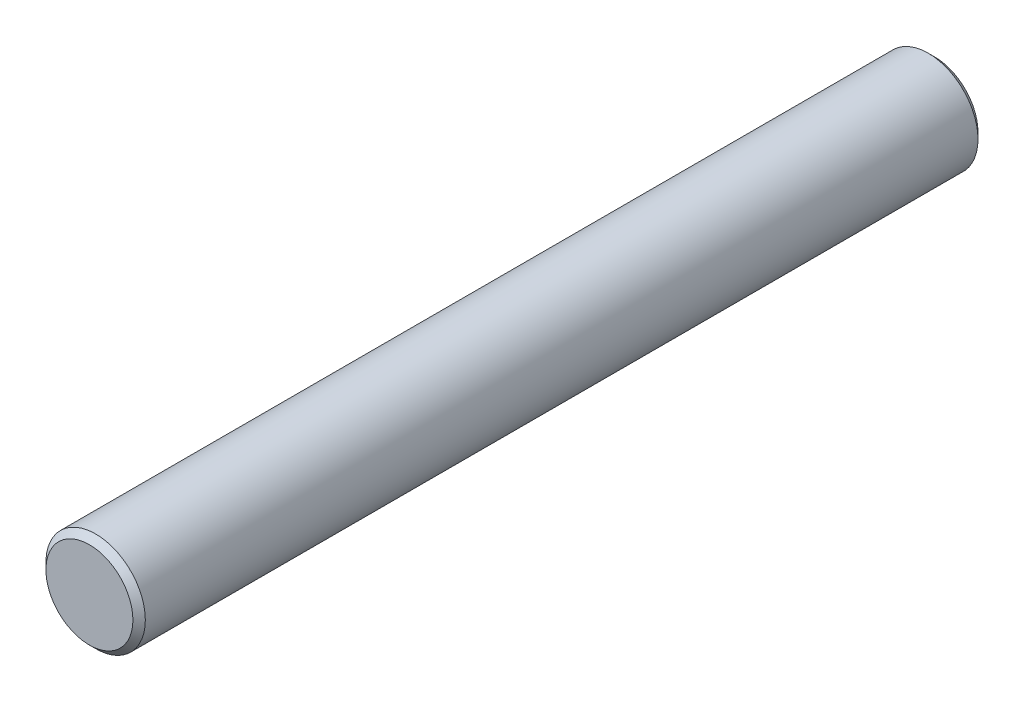
ISO-10303-21;
HEADER;
FILE_DESCRIPTION(('STEP AP214'),'2;1');
FILE_NAME('part.step','',(''),(''),'','','');
FILE_SCHEMA(('AUTOMOTIVE_DESIGN { 1 0 10303 214 1 1 1 1 }'));
ENDSEC;
DATA;
#1=APPLICATION_CONTEXT('core data for automotive mechanical design processes');
#2=APPLICATION_PROTOCOL_DEFINITION('international standard','automotive_design',2000,#1);
#3=PRODUCT_CONTEXT('',#1,'mechanical');
#4=PRODUCT('Part','Part','',(#3));
#5=PRODUCT_RELATED_PRODUCT_CATEGORY('part','',(#4));
#6=PRODUCT_DEFINITION_FORMATION('','',#4);
#7=PRODUCT_DEFINITION_CONTEXT('part definition',#1,'design');
#8=PRODUCT_DEFINITION('design','',#6,#7);
#9=PRODUCT_DEFINITION_SHAPE('','',#8);
#10=(LENGTH_UNIT() NAMED_UNIT(*) SI_UNIT(.MILLI.,.METRE.));
#11=(NAMED_UNIT(*) PLANE_ANGLE_UNIT() SI_UNIT($,.RADIAN.));
#12=(NAMED_UNIT(*) SI_UNIT($,.STERADIAN.) SOLID_ANGLE_UNIT());
#13=UNCERTAINTY_MEASURE_WITH_UNIT(LENGTH_MEASURE(1.E-05),#10,'distance_accuracy_value','');
#14=(GEOMETRIC_REPRESENTATION_CONTEXT(3) GLOBAL_UNCERTAINTY_ASSIGNED_CONTEXT((#13)) GLOBAL_UNIT_ASSIGNED_CONTEXT((#10,
#11,#12)) REPRESENTATION_CONTEXT('',''));
#15=CARTESIAN_POINT('',(0.,0.,0.));
#16=DIRECTION('',(0.,0.,1.));
#17=DIRECTION('',(1.,0.,0.));
#18=AXIS2_PLACEMENT_3D('',#15,#16,#17);
#19=CARTESIAN_POINT('',(0.,0.,68.));
#20=DIRECTION('',(0.,0.,-1.));
#21=DIRECTION('',(-1.,0.,0.));
#22=AXIS2_PLACEMENT_3D('',#19,#20,#21);
#23=CYLINDRICAL_SURFACE('',#22,8.);
#24=CARTESIAN_POINT('',(0.,0.,-67.));
#25=DIRECTION('',(0.,0.,1.));
#26=DIRECTION('',(1.,0.,0.));
#27=AXIS2_PLACEMENT_3D('',#24,#25,#26);
#28=CIRCLE('',#27,8.);
#29=CARTESIAN_POINT('',(8.,0.,-67.));
#30=VERTEX_POINT('',#29);
#31=EDGE_CURVE('E50',#30,#30,#28,.T.);
#32=ORIENTED_EDGE('',*,*,#31,.T.);
#33=EDGE_LOOP('',(#32));
#34=FACE_BOUND('',#33,.T.);
#35=CARTESIAN_POINT('',(0.,0.,67.));
#36=DIRECTION('',(0.,0.,1.));
#37=DIRECTION('',(1.,0.,0.));
#38=AXIS2_PLACEMENT_3D('',#35,#36,#37);
#39=CIRCLE('',#38,8.);
#40=CARTESIAN_POINT('',(8.,0.,67.));
#41=VERTEX_POINT('',#40);
#42=EDGE_CURVE('E55',#41,#41,#39,.F.);
#43=ORIENTED_EDGE('',*,*,#42,.T.);
#44=EDGE_LOOP('',(#43));
#45=FACE_BOUND('',#44,.T.);
#46=ADVANCED_FACE('F37',(#34,#45),#23,.T.);
#47=CARTESIAN_POINT('',(0.,0.,68.));
#48=DIRECTION('',(0.,0.,1.));
#49=DIRECTION('',(1.,0.,0.));
#50=AXIS2_PLACEMENT_3D('',#47,#48,#49);
#51=PLANE('',#50);
#52=CARTESIAN_POINT('',(0.,0.,68.));
#53=DIRECTION('',(0.,0.,1.));
#54=DIRECTION('',(1.,0.,0.));
#55=AXIS2_PLACEMENT_3D('',#52,#53,#54);
#56=CIRCLE('',#55,7.00000000000001);
#57=CARTESIAN_POINT('',(7.00000000000001,0.,68.));
#58=VERTEX_POINT('',#57);
#59=EDGE_CURVE('E10',#58,#58,#56,.T.);
#60=ORIENTED_EDGE('',*,*,#59,.T.);
#61=EDGE_LOOP('',(#60));
#62=FACE_BOUND('',#61,.T.);
#63=ADVANCED_FACE('F72',(#62),#51,.T.);
#64=CARTESIAN_POINT('',(0.,0.,-68.));
#65=DIRECTION('',(0.,0.,1.));
#66=DIRECTION('',(1.,0.,0.));
#67=AXIS2_PLACEMENT_3D('',#64,#65,#66);
#68=PLANE('',#67);
#69=CARTESIAN_POINT('',(0.,0.,-68.));
#70=DIRECTION('',(0.,0.,1.));
#71=DIRECTION('',(1.,0.,0.));
#72=AXIS2_PLACEMENT_3D('',#69,#70,#71);
#73=CIRCLE('',#72,7.00000000000001);
#74=CARTESIAN_POINT('',(7.00000000000001,0.,-68.));
#75=VERTEX_POINT('',#74);
#76=EDGE_CURVE('E45',#75,#75,#73,.F.);
#77=ORIENTED_EDGE('',*,*,#76,.T.);
#78=EDGE_LOOP('',(#77));
#79=FACE_BOUND('',#78,.T.);
#80=ADVANCED_FACE('F69',(#79),#68,.F.);
#81=CARTESIAN_POINT('',(0.,0.,-67.));
#82=DIRECTION('',(0.,0.,1.));
#83=DIRECTION('',(1.,0.,0.));
#84=AXIS2_PLACEMENT_3D('',#81,#82,#83);
#85=CONICAL_SURFACE('',#84,8.,0.785398163397445);
#86=ORIENTED_EDGE('',*,*,#76,.F.);
#87=EDGE_LOOP('',(#86));
#88=FACE_BOUND('',#87,.T.);
#89=ORIENTED_EDGE('',*,*,#31,.F.);
#90=EDGE_LOOP('',(#89));
#91=FACE_BOUND('',#90,.T.);
#92=ADVANCED_FACE('F65',(#88,#91),#85,.T.);
#93=CARTESIAN_POINT('',(0.,0.,68.));
#94=DIRECTION('',(0.,0.,-1.));
#95=DIRECTION('',(-1.,0.,0.));
#96=AXIS2_PLACEMENT_3D('',#93,#94,#95);
#97=CONICAL_SURFACE('',#96,7.00000000000001,0.785398163397445);
#98=ORIENTED_EDGE('',*,*,#42,.F.);
#99=EDGE_LOOP('',(#98));
#100=FACE_BOUND('',#99,.T.);
#101=ORIENTED_EDGE('',*,*,#59,.F.);
#102=EDGE_LOOP('',(#101));
#103=FACE_BOUND('',#102,.T.);
#104=ADVANCED_FACE('F39',(#100,#103),#97,.T.);
#105=CLOSED_SHELL('',(#46,#63,#80,#92,#104));
#106=MANIFOLD_SOLID_BREP('B2',#105);
#107=ADVANCED_BREP_SHAPE_REPRESENTATION('',(#18,#106),#14);
#108=SHAPE_DEFINITION_REPRESENTATION(#9,#107);
ENDSEC;
END-ISO-10303-21;
